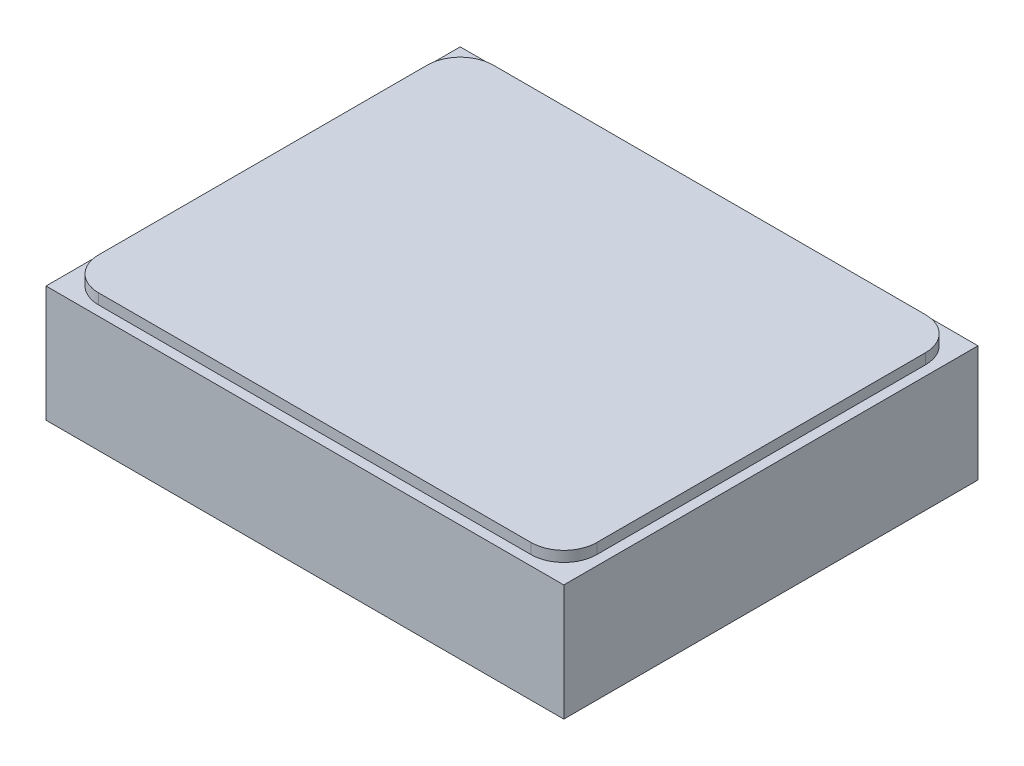
ISO-10303-21;
HEADER;
FILE_DESCRIPTION(('STEP AP214'),'2;1');
FILE_NAME('part.step','',(''),(''),'','','');
FILE_SCHEMA(('AUTOMOTIVE_DESIGN { 1 0 10303 214 1 1 1 1 }'));
ENDSEC;
DATA;
#1=APPLICATION_CONTEXT('core data for automotive mechanical design processes');
#2=APPLICATION_PROTOCOL_DEFINITION('international standard','automotive_design',2000,#1);
#3=PRODUCT_CONTEXT('',#1,'mechanical');
#4=PRODUCT('Part','Part','',(#3));
#5=PRODUCT_RELATED_PRODUCT_CATEGORY('part','',(#4));
#6=PRODUCT_DEFINITION_FORMATION('','',#4);
#7=PRODUCT_DEFINITION_CONTEXT('part definition',#1,'design');
#8=PRODUCT_DEFINITION('design','',#6,#7);
#9=PRODUCT_DEFINITION_SHAPE('','',#8);
#10=(LENGTH_UNIT() NAMED_UNIT(*) SI_UNIT(.MILLI.,.METRE.));
#11=(NAMED_UNIT(*) PLANE_ANGLE_UNIT() SI_UNIT($,.RADIAN.));
#12=(NAMED_UNIT(*) SI_UNIT($,.STERADIAN.) SOLID_ANGLE_UNIT());
#13=UNCERTAINTY_MEASURE_WITH_UNIT(LENGTH_MEASURE(1.E-05),#10,'distance_accuracy_value','');
#14=(GEOMETRIC_REPRESENTATION_CONTEXT(3) GLOBAL_UNCERTAINTY_ASSIGNED_CONTEXT((#13)) GLOBAL_UNIT_ASSIGNED_CONTEXT((#10,
#11,#12)) REPRESENTATION_CONTEXT('',''));
#15=CARTESIAN_POINT('',(0.,0.,0.));
#16=DIRECTION('',(0.,0.,1.));
#17=DIRECTION('',(1.,0.,0.));
#18=AXIS2_PLACEMENT_3D('',#15,#16,#17);
#19=CARTESIAN_POINT('',(-25.,11.9888,-20.));
#20=DIRECTION('',(0.,-1.,0.));
#21=DIRECTION('',(0.,0.,-1.));
#22=AXIS2_PLACEMENT_3D('',#19,#20,#21);
#23=PLANE('',#22);
#24=DIRECTION('',(0.,0.,1.));
#25=VECTOR('',#24,1.);
#26=CARTESIAN_POINT('',(-25.,11.9888,20.));
#27=LINE('',#26,#25);
#28=CARTESIAN_POINT('',(-25.,11.9888,-20.));
#29=VERTEX_POINT('',#28);
#30=CARTESIAN_POINT('',(-25.,11.9888,20.));
#31=VERTEX_POINT('',#30);
#32=EDGE_CURVE('E225',#29,#31,#27,.T.);
#33=ORIENTED_EDGE('',*,*,#32,.T.);
#34=DIRECTION('',(1.,0.,0.));
#35=VECTOR('',#34,1.);
#36=CARTESIAN_POINT('',(-25.,11.9888,20.));
#37=LINE('',#36,#35);
#38=CARTESIAN_POINT('',(25.,11.9888,20.));
#39=VERTEX_POINT('',#38);
#40=EDGE_CURVE('E228',#31,#39,#37,.T.);
#41=ORIENTED_EDGE('',*,*,#40,.T.);
#42=DIRECTION('',(0.,0.,-1.));
#43=VECTOR('',#42,1.);
#44=CARTESIAN_POINT('',(25.,11.9888,20.));
#45=LINE('',#44,#43);
#46=CARTESIAN_POINT('',(25.,11.9888,-20.));
#47=VERTEX_POINT('',#46);
#48=EDGE_CURVE('E230',#39,#47,#45,.T.);
#49=ORIENTED_EDGE('',*,*,#48,.T.);
#50=DIRECTION('',(-1.,0.,0.));
#51=VECTOR('',#50,1.);
#52=CARTESIAN_POINT('',(-25.,11.9888,-20.));
#53=LINE('',#52,#51);
#54=EDGE_CURVE('E232',#47,#29,#53,.T.);
#55=ORIENTED_EDGE('',*,*,#54,.T.);
#56=EDGE_LOOP('',(#33,#41,#49,#55));
#57=FACE_BOUND('',#56,.T.);
#58=CARTESIAN_POINT('',(-20.8725,11.9888,15.8725));
#59=DIRECTION('',(0.,1.,0.));
#60=DIRECTION('',(0.,0.,-1.));
#61=AXIS2_PLACEMENT_3D('',#58,#59,#60);
#62=CIRCLE('',#61,3.175);
#63=CARTESIAN_POINT('',(-24.0475,11.9888,15.8725));
#64=VERTEX_POINT('',#63);
#65=CARTESIAN_POINT('',(-20.8725,11.9888,19.0475));
#66=VERTEX_POINT('',#65);
#67=EDGE_CURVE('E173',#64,#66,#62,.T.);
#68=ORIENTED_EDGE('',*,*,#67,.F.);
#69=DIRECTION('',(0.,0.,1.));
#70=VECTOR('',#69,1.);
#71=CARTESIAN_POINT('',(-24.0475,11.9888,15.8725));
#72=LINE('',#71,#70);
#73=CARTESIAN_POINT('',(-24.0475,11.9888,-15.8775));
#74=VERTEX_POINT('',#73);
#75=EDGE_CURVE('E170',#74,#64,#72,.T.);
#76=ORIENTED_EDGE('',*,*,#75,.F.);
#77=CARTESIAN_POINT('',(-20.8725,11.9888,-15.8775));
#78=DIRECTION('',(0.,1.,0.));
#79=DIRECTION('',(0.,0.,-1.));
#80=AXIS2_PLACEMENT_3D('',#77,#78,#79);
#81=CIRCLE('',#80,3.175);
#82=CARTESIAN_POINT('',(-20.8725,11.9888,-19.0525));
#83=VERTEX_POINT('',#82);
#84=EDGE_CURVE('E646',#83,#74,#81,.T.);
#85=ORIENTED_EDGE('',*,*,#84,.F.);
#86=DIRECTION('',(-1.,0.,0.));
#87=VECTOR('',#86,1.);
#88=CARTESIAN_POINT('',(-20.8725,11.9888,-19.0525));
#89=LINE('',#88,#87);
#90=CARTESIAN_POINT('',(20.8851,11.9888,-19.0525));
#91=VERTEX_POINT('',#90);
#92=EDGE_CURVE('E677',#91,#83,#89,.T.);
#93=ORIENTED_EDGE('',*,*,#92,.F.);
#94=CARTESIAN_POINT('',(20.8851,11.9888,-15.8775));
#95=DIRECTION('',(0.,1.,0.));
#96=DIRECTION('',(0.,0.,-1.));
#97=AXIS2_PLACEMENT_3D('',#94,#95,#96);
#98=CIRCLE('',#97,3.175);
#99=CARTESIAN_POINT('',(24.0601,11.9888,-15.8775));
#100=VERTEX_POINT('',#99);
#101=EDGE_CURVE('E670',#100,#91,#98,.T.);
#102=ORIENTED_EDGE('',*,*,#101,.F.);
#103=DIRECTION('',(0.,0.,-1.));
#104=VECTOR('',#103,1.);
#105=CARTESIAN_POINT('',(24.0601,11.9888,15.8725));
#106=LINE('',#105,#104);
#107=CARTESIAN_POINT('',(24.0601,11.9888,15.8725));
#108=VERTEX_POINT('',#107);
#109=EDGE_CURVE('E667',#108,#100,#106,.T.);
#110=ORIENTED_EDGE('',*,*,#109,.F.);
#111=CARTESIAN_POINT('',(20.8851,11.9888,15.8725));
#112=DIRECTION('',(0.,1.,0.));
#113=DIRECTION('',(0.,0.,1.));
#114=AXIS2_PLACEMENT_3D('',#111,#112,#113);
#115=CIRCLE('',#114,3.175);
#116=CARTESIAN_POINT('',(20.8851,11.9888,19.0475));
#117=VERTEX_POINT('',#116);
#118=EDGE_CURVE('E58',#117,#108,#115,.T.);
#119=ORIENTED_EDGE('',*,*,#118,.F.);
#120=DIRECTION('',(1.,0.,0.));
#121=VECTOR('',#120,1.);
#122=CARTESIAN_POINT('',(-20.8725,11.9888,19.0475));
#123=LINE('',#122,#121);
#124=EDGE_CURVE('E53',#66,#117,#123,.T.);
#125=ORIENTED_EDGE('',*,*,#124,.F.);
#126=EDGE_LOOP('',(#68,#76,#85,#93,#102,#110,#119,#125));
#127=FACE_BOUND('',#126,.T.);
#128=ADVANCED_FACE('F36',(#57,#127),#23,.F.);
#129=CARTESIAN_POINT('',(-25.,11.9888,20.));
#130=DIRECTION('',(1.,0.,0.));
#131=DIRECTION('',(0.,0.,-1.));
#132=AXIS2_PLACEMENT_3D('',#129,#130,#131);
#133=PLANE('',#132);
#134=DIRECTION('',(0.,-1.,0.));
#135=VECTOR('',#134,1.);
#136=CARTESIAN_POINT('',(-25.,11.9888,-20.));
#137=LINE('',#136,#135);
#138=CARTESIAN_POINT('',(-25.,0.762000000000002,-20.));
#139=VERTEX_POINT('',#138);
#140=EDGE_CURVE('E234',#29,#139,#137,.T.);
#141=ORIENTED_EDGE('',*,*,#140,.T.);
#142=DIRECTION('',(0.,0.,1.));
#143=VECTOR('',#142,1.);
#144=CARTESIAN_POINT('',(-25.,0.761999999999999,20.));
#145=LINE('',#144,#143);
#146=CARTESIAN_POINT('',(-25.,0.762000000000002,20.));
#147=VERTEX_POINT('',#146);
#148=EDGE_CURVE('E11',#139,#147,#145,.T.);
#149=ORIENTED_EDGE('',*,*,#148,.T.);
#150=DIRECTION('',(0.,-1.,0.));
#151=VECTOR('',#150,1.);
#152=CARTESIAN_POINT('',(-25.,11.9888,20.));
#153=LINE('',#152,#151);
#154=EDGE_CURVE('E243',#31,#147,#153,.T.);
#155=ORIENTED_EDGE('',*,*,#154,.F.);
#156=ORIENTED_EDGE('',*,*,#32,.F.);
#157=EDGE_LOOP('',(#141,#149,#155,#156));
#158=FACE_BOUND('',#157,.T.);
#159=ADVANCED_FACE('F296',(#158),#133,.F.);
#160=CARTESIAN_POINT('',(-25.,11.9888,20.));
#161=DIRECTION('',(0.,0.,-1.));
#162=DIRECTION('',(-1.,0.,0.));
#163=AXIS2_PLACEMENT_3D('',#160,#161,#162);
#164=PLANE('',#163);
#165=ORIENTED_EDGE('',*,*,#154,.T.);
#166=DIRECTION('',(1.,0.,0.));
#167=VECTOR('',#166,1.);
#168=CARTESIAN_POINT('',(25.,0.761999999999999,20.));
#169=LINE('',#168,#167);
#170=CARTESIAN_POINT('',(25.,0.762000000000002,20.));
#171=VERTEX_POINT('',#170);
#172=EDGE_CURVE('E45',#147,#171,#169,.T.);
#173=ORIENTED_EDGE('',*,*,#172,.T.);
#174=DIRECTION('',(0.,-1.,0.));
#175=VECTOR('',#174,1.);
#176=CARTESIAN_POINT('',(25.,11.9888,20.));
#177=LINE('',#176,#175);
#178=EDGE_CURVE('E240',#39,#171,#177,.T.);
#179=ORIENTED_EDGE('',*,*,#178,.F.);
#180=ORIENTED_EDGE('',*,*,#40,.F.);
#181=EDGE_LOOP('',(#165,#173,#179,#180));
#182=FACE_BOUND('',#181,.T.);
#183=ADVANCED_FACE('F303',(#182),#164,.F.);
#184=CARTESIAN_POINT('',(25.,11.9888,20.));
#185=DIRECTION('',(-1.,0.,0.));
#186=DIRECTION('',(0.,0.,1.));
#187=AXIS2_PLACEMENT_3D('',#184,#185,#186);
#188=PLANE('',#187);
#189=ORIENTED_EDGE('',*,*,#178,.T.);
#190=DIRECTION('',(0.,0.,-1.));
#191=VECTOR('',#190,1.);
#192=CARTESIAN_POINT('',(25.,0.761999999999999,-20.));
#193=LINE('',#192,#191);
#194=CARTESIAN_POINT('',(25.,0.762000000000002,-20.));
#195=VERTEX_POINT('',#194);
#196=EDGE_CURVE('E260',#171,#195,#193,.T.);
#197=ORIENTED_EDGE('',*,*,#196,.T.);
#198=DIRECTION('',(0.,-1.,0.));
#199=VECTOR('',#198,1.);
#200=CARTESIAN_POINT('',(25.,11.9888,-20.));
#201=LINE('',#200,#199);
#202=EDGE_CURVE('E237',#47,#195,#201,.T.);
#203=ORIENTED_EDGE('',*,*,#202,.F.);
#204=ORIENTED_EDGE('',*,*,#48,.F.);
#205=EDGE_LOOP('',(#189,#197,#203,#204));
#206=FACE_BOUND('',#205,.T.);
#207=ADVANCED_FACE('F301',(#206),#188,.F.);
#208=CARTESIAN_POINT('',(-25.,11.9888,-20.));
#209=DIRECTION('',(0.,0.,1.));
#210=DIRECTION('',(1.,0.,0.));
#211=AXIS2_PLACEMENT_3D('',#208,#209,#210);
#212=PLANE('',#211);
#213=CARTESIAN_POINT('',(0.,5.334,-20.));
#214=DIRECTION('',(0.,0.,-1.));
#215=DIRECTION('',(-1.,0.,0.));
#216=AXIS2_PLACEMENT_3D('',#213,#214,#215);
#217=CIRCLE('',#216,2.09999999999999);
#218=CARTESIAN_POINT('',(-2.09999999999999,5.334,-20.));
#219=VERTEX_POINT('',#218);
#220=EDGE_CURVE('E222',#219,#219,#217,.T.);
#221=ORIENTED_EDGE('',*,*,#220,.F.);
#222=EDGE_LOOP('',(#221));
#223=FACE_BOUND('',#222,.T.);
#224=ORIENTED_EDGE('',*,*,#202,.T.);
#225=DIRECTION('',(-1.,0.,0.));
#226=VECTOR('',#225,1.);
#227=CARTESIAN_POINT('',(-25.,0.761999999999999,-20.));
#228=LINE('',#227,#226);
#229=EDGE_CURVE('E246',#195,#139,#228,.T.);
#230=ORIENTED_EDGE('',*,*,#229,.T.);
#231=ORIENTED_EDGE('',*,*,#140,.F.);
#232=ORIENTED_EDGE('',*,*,#54,.F.);
#233=EDGE_LOOP('',(#224,#230,#231,#232));
#234=FACE_BOUND('',#233,.T.);
#235=ADVANCED_FACE('F292',(#223,#234),#212,.F.);
#236=CARTESIAN_POINT('',(-25.,0.,-20.));
#237=DIRECTION('',(0.,-1.,0.));
#238=DIRECTION('',(0.,0.,-1.));
#239=AXIS2_PLACEMENT_3D('',#236,#237,#238);
#240=PLANE('',#239);
#241=DIRECTION('',(0.,0.,-1.));
#242=VECTOR('',#241,1.);
#243=CARTESIAN_POINT('',(-24.238,0.,-20.));
#244=LINE('',#243,#242);
#245=CARTESIAN_POINT('',(-24.238,0.,19.238));
#246=VERTEX_POINT('',#245);
#247=CARTESIAN_POINT('',(-24.238,0.,-19.238));
#248=VERTEX_POINT('',#247);
#249=EDGE_CURVE('E251',#246,#248,#244,.T.);
#250=ORIENTED_EDGE('',*,*,#249,.T.);
#251=DIRECTION('',(1.,0.,0.));
#252=VECTOR('',#251,1.);
#253=CARTESIAN_POINT('',(25.,0.,-19.238));
#254=LINE('',#253,#252);
#255=CARTESIAN_POINT('',(24.238,0.,-19.238));
#256=VERTEX_POINT('',#255);
#257=EDGE_CURVE('E257',#248,#256,#254,.T.);
#258=ORIENTED_EDGE('',*,*,#257,.T.);
#259=DIRECTION('',(0.,0.,1.));
#260=VECTOR('',#259,1.);
#261=CARTESIAN_POINT('',(24.238,0.,20.));
#262=LINE('',#261,#260);
#263=CARTESIAN_POINT('',(24.238,0.,19.238));
#264=VERTEX_POINT('',#263);
#265=EDGE_CURVE('E255',#256,#264,#262,.T.);
#266=ORIENTED_EDGE('',*,*,#265,.T.);
#267=DIRECTION('',(-1.,0.,0.));
#268=VECTOR('',#267,1.);
#269=CARTESIAN_POINT('',(-25.,0.,19.238));
#270=LINE('',#269,#268);
#271=EDGE_CURVE('E253',#264,#246,#270,.T.);
#272=ORIENTED_EDGE('',*,*,#271,.T.);
#273=EDGE_LOOP('',(#250,#258,#266,#272));
#274=FACE_BOUND('',#273,.T.);
#275=CARTESIAN_POINT('',(-17.,0.,0.));
#276=DIRECTION('',(0.,-1.,0.));
#277=DIRECTION('',(0.,0.,-1.));
#278=AXIS2_PLACEMENT_3D('',#275,#276,#277);
#279=CIRCLE('',#278,1.25);
#280=CARTESIAN_POINT('',(-17.,0.,-1.25));
#281=VERTEX_POINT('',#280);
#282=EDGE_CURVE('E185',#281,#281,#279,.T.);
#283=ORIENTED_EDGE('',*,*,#282,.F.);
#284=EDGE_LOOP('',(#283));
#285=FACE_BOUND('',#284,.T.);
#286=CARTESIAN_POINT('',(0.,0.,0.));
#287=DIRECTION('',(0.,-1.,0.));
#288=DIRECTION('',(0.,0.,-1.));
#289=AXIS2_PLACEMENT_3D('',#286,#287,#288);
#290=CIRCLE('',#289,6.48252587808178);
#291=CARTESIAN_POINT('',(0.,0.,-6.48252587808178));
#292=VERTEX_POINT('',#291);
#293=EDGE_CURVE('E189',#292,#292,#290,.T.);
#294=ORIENTED_EDGE('',*,*,#293,.F.);
#295=EDGE_LOOP('',(#294));
#296=FACE_BOUND('',#295,.T.);
#297=CARTESIAN_POINT('',(5.39749999999991,0.,-9.34874423385306));
#298=DIRECTION('',(0.,-1.,0.));
#299=DIRECTION('',(0.,0.,-1.));
#300=AXIS2_PLACEMENT_3D('',#297,#298,#299);
#301=CIRCLE('',#300,1.25);
#302=CARTESIAN_POINT('',(5.39749999999991,0.,-10.5987442338531));
#303=VERTEX_POINT('',#302);
#304=EDGE_CURVE('E198',#303,#303,#301,.T.);
#305=ORIENTED_EDGE('',*,*,#304,.F.);
#306=EDGE_LOOP('',(#305));
#307=FACE_BOUND('',#306,.T.);
#308=CARTESIAN_POINT('',(5.39750000000004,0.,9.34874423385299));
#309=DIRECTION('',(0.,-1.,0.));
#310=DIRECTION('',(0.,0.,-1.));
#311=AXIS2_PLACEMENT_3D('',#308,#309,#310);
#312=CIRCLE('',#311,1.25);
#313=CARTESIAN_POINT('',(5.39750000000004,0.,8.09874423385299));
#314=VERTEX_POINT('',#313);
#315=EDGE_CURVE('E204',#314,#314,#312,.T.);
#316=ORIENTED_EDGE('',*,*,#315,.F.);
#317=EDGE_LOOP('',(#316));
#318=FACE_BOUND('',#317,.T.);
#319=CARTESIAN_POINT('',(-10.795,0.,0.));
#320=DIRECTION('',(0.,-1.,0.));
#321=DIRECTION('',(0.,0.,-1.));
#322=AXIS2_PLACEMENT_3D('',#319,#320,#321);
#323=CIRCLE('',#322,1.25);
#324=CARTESIAN_POINT('',(-10.795,0.,-1.25));
#325=VERTEX_POINT('',#324);
#326=EDGE_CURVE('E210',#325,#325,#323,.T.);
#327=ORIENTED_EDGE('',*,*,#326,.F.);
#328=EDGE_LOOP('',(#327));
#329=FACE_BOUND('',#328,.T.);
#330=CARTESIAN_POINT('',(17.,0.,0.));
#331=DIRECTION('',(0.,-1.,0.));
#332=DIRECTION('',(0.,0.,-1.));
#333=AXIS2_PLACEMENT_3D('',#330,#331,#332);
#334=CIRCLE('',#333,1.58749999999996);
#335=CARTESIAN_POINT('',(17.,0.,-1.58749999999996));
#336=VERTEX_POINT('',#335);
#337=EDGE_CURVE('E216',#336,#336,#334,.T.);
#338=ORIENTED_EDGE('',*,*,#337,.F.);
#339=EDGE_LOOP('',(#338));
#340=FACE_BOUND('',#339,.T.);
#341=ADVANCED_FACE('F280',(#274,#285,#296,#307,#318,#329,#340),#240,.T.);
#342=CARTESIAN_POINT('',(0.,5.334,-20.));
#343=DIRECTION('',(0.,0.,-1.));
#344=DIRECTION('',(-1.,0.,0.));
#345=AXIS2_PLACEMENT_3D('',#342,#343,#344);
#346=CYLINDRICAL_SURFACE('',#345,2.09999999999999);
#347=CARTESIAN_POINT('',(0.,5.334,-10.4242));
#348=DIRECTION('',(0.,0.,-1.));
#349=DIRECTION('',(-1.,0.,0.));
#350=AXIS2_PLACEMENT_3D('',#347,#348,#349);
#351=CIRCLE('',#350,2.1);
#352=CARTESIAN_POINT('',(-2.1,5.334,-10.4242));
#353=VERTEX_POINT('',#352);
#354=EDGE_CURVE('E219',#353,#353,#351,.T.);
#355=ORIENTED_EDGE('',*,*,#354,.F.);
#356=EDGE_LOOP('',(#355));
#357=FACE_BOUND('',#356,.T.);
#358=ORIENTED_EDGE('',*,*,#220,.T.);
#359=EDGE_LOOP('',(#358));
#360=FACE_BOUND('',#359,.T.);
#361=ADVANCED_FACE('F318',(#357,#360),#346,.F.);
#362=CARTESIAN_POINT('',(0.,5.334,-10.4242));
#363=DIRECTION('',(0.,0.,-1.));
#364=DIRECTION('',(-1.,0.,0.));
#365=AXIS2_PLACEMENT_3D('',#362,#363,#364);
#366=CONICAL_SURFACE('',#365,2.1,1.02974425867665);
#367=CARTESIAN_POINT('',(0.,5.334,-9.16239270004212));
#368=VERTEX_POINT('',#367);
#369=VERTEX_LOOP('',#368);
#370=FACE_BOUND('',#369,.T.);
#371=ORIENTED_EDGE('',*,*,#354,.T.);
#372=EDGE_LOOP('',(#371));
#373=FACE_BOUND('',#372,.T.);
#374=ADVANCED_FACE('F329',(#370,#373),#366,.F.);
#375=CARTESIAN_POINT('',(17.,0.,0.));
#376=DIRECTION('',(0.,-1.,0.));
#377=DIRECTION('',(0.,0.,-1.));
#378=AXIS2_PLACEMENT_3D('',#375,#376,#377);
#379=CYLINDRICAL_SURFACE('',#378,1.58749999999996);
#380=CARTESIAN_POINT('',(17.,6.35000000000002,0.));
#381=DIRECTION('',(0.,-1.,0.));
#382=DIRECTION('',(0.,0.,-1.));
#383=AXIS2_PLACEMENT_3D('',#380,#381,#382);
#384=CIRCLE('',#383,1.58749999999996);
#385=CARTESIAN_POINT('',(17.,6.35000000000002,-1.58749999999996));
#386=VERTEX_POINT('',#385);
#387=EDGE_CURVE('E213',#386,#386,#384,.T.);
#388=ORIENTED_EDGE('',*,*,#387,.F.);
#389=EDGE_LOOP('',(#388));
#390=FACE_BOUND('',#389,.T.);
#391=ORIENTED_EDGE('',*,*,#337,.T.);
#392=EDGE_LOOP('',(#391));
#393=FACE_BOUND('',#392,.T.);
#394=ADVANCED_FACE('F334',(#390,#393),#379,.F.);
#395=CARTESIAN_POINT('',(17.,6.35000000000001,0.));
#396=DIRECTION('',(0.,1.,0.));
#397=DIRECTION('',(0.,0.,1.));
#398=AXIS2_PLACEMENT_3D('',#395,#396,#397);
#399=PLANE('',#398);
#400=ORIENTED_EDGE('',*,*,#387,.T.);
#401=EDGE_LOOP('',(#400));
#402=FACE_BOUND('',#401,.T.);
#403=ADVANCED_FACE('F341',(#402),#399,.F.);
#404=CARTESIAN_POINT('',(-10.795,0.,0.));
#405=DIRECTION('',(0.,-1.,0.));
#406=DIRECTION('',(0.,0.,-1.));
#407=AXIS2_PLACEMENT_3D('',#404,#405,#406);
#408=CYLINDRICAL_SURFACE('',#407,1.25);
#409=CARTESIAN_POINT('',(-10.795,6.5532,0.));
#410=DIRECTION('',(0.,-1.,0.));
#411=DIRECTION('',(0.,0.,-1.));
#412=AXIS2_PLACEMENT_3D('',#409,#410,#411);
#413=CIRCLE('',#412,1.25);
#414=CARTESIAN_POINT('',(-10.795,6.5532,-1.25));
#415=VERTEX_POINT('',#414);
#416=EDGE_CURVE('E207',#415,#415,#413,.T.);
#417=ORIENTED_EDGE('',*,*,#416,.F.);
#418=EDGE_LOOP('',(#417));
#419=FACE_BOUND('',#418,.T.);
#420=ORIENTED_EDGE('',*,*,#326,.T.);
#421=EDGE_LOOP('',(#420));
#422=FACE_BOUND('',#421,.T.);
#423=ADVANCED_FACE('F347',(#419,#422),#408,.F.);
#424=CARTESIAN_POINT('',(-10.795,6.5532,0.));
#425=DIRECTION('',(0.,-1.,0.));
#426=DIRECTION('',(0.,0.,-1.));
#427=AXIS2_PLACEMENT_3D('',#424,#425,#426);
#428=CONICAL_SURFACE('',#427,1.25,1.02974425867665);
#429=CARTESIAN_POINT('',(-10.795,7.30427577378445,0.));
#430=VERTEX_POINT('',#429);
#431=VERTEX_LOOP('',#430);
#432=FACE_BOUND('',#431,.T.);
#433=ORIENTED_EDGE('',*,*,#416,.T.);
#434=EDGE_LOOP('',(#433));
#435=FACE_BOUND('',#434,.T.);
#436=ADVANCED_FACE('F351',(#432,#435),#428,.F.);
#437=CARTESIAN_POINT('',(5.39750000000004,0.,9.34874423385299));
#438=DIRECTION('',(0.,-1.,0.));
#439=DIRECTION('',(0.,0.,-1.));
#440=AXIS2_PLACEMENT_3D('',#437,#438,#439);
#441=CYLINDRICAL_SURFACE('',#440,1.25);
#442=CARTESIAN_POINT('',(5.39750000000004,6.5532,9.34874423385299));
#443=DIRECTION('',(0.,-1.,0.));
#444=DIRECTION('',(0.,0.,-1.));
#445=AXIS2_PLACEMENT_3D('',#442,#443,#444);
#446=CIRCLE('',#445,1.25);
#447=CARTESIAN_POINT('',(5.39750000000004,6.5532,8.09874423385299));
#448=VERTEX_POINT('',#447);
#449=EDGE_CURVE('E201',#448,#448,#446,.T.);
#450=ORIENTED_EDGE('',*,*,#449,.F.);
#451=EDGE_LOOP('',(#450));
#452=FACE_BOUND('',#451,.T.);
#453=ORIENTED_EDGE('',*,*,#315,.T.);
#454=EDGE_LOOP('',(#453));
#455=FACE_BOUND('',#454,.T.);
#456=ADVANCED_FACE('F355',(#452,#455),#441,.F.);
#457=CARTESIAN_POINT('',(5.39750000000004,6.5532,9.34874423385299));
#458=DIRECTION('',(0.,-1.,0.));
#459=DIRECTION('',(0.,0.,-1.));
#460=AXIS2_PLACEMENT_3D('',#457,#458,#459);
#461=CONICAL_SURFACE('',#460,1.25,1.02974425867665);
#462=CARTESIAN_POINT('',(5.39750000000004,7.30427577378445,9.34874423385299));
#463=VERTEX_POINT('',#462);
#464=VERTEX_LOOP('',#463);
#465=FACE_BOUND('',#464,.T.);
#466=ORIENTED_EDGE('',*,*,#449,.T.);
#467=EDGE_LOOP('',(#466));
#468=FACE_BOUND('',#467,.T.);
#469=ADVANCED_FACE('F359',(#465,#468),#461,.F.);
#470=CARTESIAN_POINT('',(5.39749999999991,0.,-9.34874423385306));
#471=DIRECTION('',(0.,-1.,0.));
#472=DIRECTION('',(0.,0.,-1.));
#473=AXIS2_PLACEMENT_3D('',#470,#471,#472);
#474=CYLINDRICAL_SURFACE('',#473,1.25);
#475=CARTESIAN_POINT('',(5.39749999999991,6.5532,-9.34874423385306));
#476=DIRECTION('',(0.,-1.,0.));
#477=DIRECTION('',(0.,0.,-1.));
#478=AXIS2_PLACEMENT_3D('',#475,#476,#477);
#479=CIRCLE('',#478,1.25);
#480=CARTESIAN_POINT('',(5.39749999999991,6.5532,-10.5987442338531));
#481=VERTEX_POINT('',#480);
#482=EDGE_CURVE('E195',#481,#481,#479,.T.);
#483=ORIENTED_EDGE('',*,*,#482,.F.);
#484=EDGE_LOOP('',(#483));
#485=FACE_BOUND('',#484,.T.);
#486=ORIENTED_EDGE('',*,*,#304,.T.);
#487=EDGE_LOOP('',(#486));
#488=FACE_BOUND('',#487,.T.);
#489=ADVANCED_FACE('F363',(#485,#488),#474,.F.);
#490=CARTESIAN_POINT('',(5.39749999999991,6.5532,-9.34874423385306));
#491=DIRECTION('',(0.,-1.,0.));
#492=DIRECTION('',(0.,0.,-1.));
#493=AXIS2_PLACEMENT_3D('',#490,#491,#492);
#494=CONICAL_SURFACE('',#493,1.25,1.02974425867665);
#495=CARTESIAN_POINT('',(5.39749999999991,7.30427577378445,-9.34874423385306));
#496=VERTEX_POINT('',#495);
#497=VERTEX_LOOP('',#496);
#498=FACE_BOUND('',#497,.T.);
#499=ORIENTED_EDGE('',*,*,#482,.T.);
#500=EDGE_LOOP('',(#499));
#501=FACE_BOUND('',#500,.T.);
#502=ADVANCED_FACE('F367',(#498,#501),#494,.F.);
#503=CARTESIAN_POINT('',(0.,-0.508,0.));
#504=DIRECTION('',(0.,0.,-1.));
#505=DIRECTION('',(1.,0.,0.));
#506=AXIS2_PLACEMENT_3D('',#503,#504,#505);
#507=SPHERICAL_SURFACE('',#506,6.5024);
#508=CARTESIAN_POINT('',(0.,-0.508,0.));
#509=DIRECTION('',(0.,-1.,0.));
#510=DIRECTION('',(0.,0.,-1.));
#511=AXIS2_PLACEMENT_3D('',#508,#509,#510);
#512=SPHERICAL_SURFACE('',#511,6.5024);
#513=ORIENTED_EDGE('',*,*,#293,.T.);
#514=EDGE_LOOP('',(#513));
#515=FACE_BOUND('',#514,.T.);
#516=CARTESIAN_POINT('',(0.,5.68420975253383,0.));
#517=DIRECTION('',(0.,-1.,0.));
#518=DIRECTION('',(0.,0.,-1.));
#519=AXIS2_PLACEMENT_3D('',#516,#517,#518);
#520=CIRCLE('',#519,1.984375);
#521=CARTESIAN_POINT('',(0.,5.68420975253383,-1.984375));
#522=VERTEX_POINT('',#521);
#523=EDGE_CURVE('E188',#522,#522,#520,.T.);
#524=ORIENTED_EDGE('',*,*,#523,.F.);
#525=EDGE_LOOP('',(#524));
#526=FACE_BOUND('',#525,.T.);
#527=ADVANCED_FACE('F371',(#515,#526),#512,.F.);
#528=CARTESIAN_POINT('',(0.,6.2484,0.));
#529=DIRECTION('',(0.,1.,0.));
#530=DIRECTION('',(0.,0.,1.));
#531=AXIS2_PLACEMENT_3D('',#528,#529,#530);
#532=PLANE('',#531);
#533=CARTESIAN_POINT('',(0.,6.2484,0.));
#534=DIRECTION('',(0.,-1.,0.));
#535=DIRECTION('',(0.,0.,-1.));
#536=AXIS2_PLACEMENT_3D('',#533,#534,#535);
#537=CIRCLE('',#536,1.984375);
#538=CARTESIAN_POINT('',(0.,6.2484,-1.984375));
#539=VERTEX_POINT('',#538);
#540=EDGE_CURVE('E192',#539,#539,#537,.T.);
#541=ORIENTED_EDGE('',*,*,#540,.T.);
#542=EDGE_LOOP('',(#541));
#543=FACE_BOUND('',#542,.T.);
#544=ADVANCED_FACE('F377',(#543),#532,.F.);
#545=CARTESIAN_POINT('',(0.,0.,0.));
#546=DIRECTION('',(0.,-1.,0.));
#547=DIRECTION('',(0.,0.,-1.));
#548=AXIS2_PLACEMENT_3D('',#545,#546,#547);
#549=CYLINDRICAL_SURFACE('',#548,1.984375);
#550=ORIENTED_EDGE('',*,*,#523,.T.);
#551=EDGE_LOOP('',(#550));
#552=FACE_BOUND('',#551,.T.);
#553=ORIENTED_EDGE('',*,*,#540,.F.);
#554=EDGE_LOOP('',(#553));
#555=FACE_BOUND('',#554,.T.);
#556=ADVANCED_FACE('F373',(#552,#555),#549,.F.);
#557=CARTESIAN_POINT('',(-17.,0.,0.));
#558=DIRECTION('',(0.,-1.,0.));
#559=DIRECTION('',(0.,0.,-1.));
#560=AXIS2_PLACEMENT_3D('',#557,#558,#559);
#561=CYLINDRICAL_SURFACE('',#560,1.25);
#562=CARTESIAN_POINT('',(-17.,5.7912,0.));
#563=DIRECTION('',(0.,-1.,0.));
#564=DIRECTION('',(0.,0.,-1.));
#565=AXIS2_PLACEMENT_3D('',#562,#563,#564);
#566=CIRCLE('',#565,1.25);
#567=CARTESIAN_POINT('',(-17.,5.7912,-1.25));
#568=VERTEX_POINT('',#567);
#569=EDGE_CURVE('E182',#568,#568,#566,.T.);
#570=ORIENTED_EDGE('',*,*,#569,.F.);
#571=EDGE_LOOP('',(#570));
#572=FACE_BOUND('',#571,.T.);
#573=ORIENTED_EDGE('',*,*,#282,.T.);
#574=EDGE_LOOP('',(#573));
#575=FACE_BOUND('',#574,.T.);
#576=ADVANCED_FACE('F376',(#572,#575),#561,.F.);
#577=CARTESIAN_POINT('',(-17.,5.7912,0.));
#578=DIRECTION('',(0.,-1.,0.));
#579=DIRECTION('',(0.,0.,-1.));
#580=AXIS2_PLACEMENT_3D('',#577,#578,#579);
#581=CONICAL_SURFACE('',#580,1.25,1.02974425867665);
#582=CARTESIAN_POINT('',(-17.,6.54227577378445,0.));
#583=VERTEX_POINT('',#582);
#584=VERTEX_LOOP('',#583);
#585=FACE_BOUND('',#584,.T.);
#586=ORIENTED_EDGE('',*,*,#569,.T.);
#587=EDGE_LOOP('',(#586));
#588=FACE_BOUND('',#587,.T.);
#589=ADVANCED_FACE('F387',(#585,#588),#581,.F.);
#590=CARTESIAN_POINT('',(-25.,0.761999999999999,20.));
#591=DIRECTION('',(0.,-0.707106781186548,0.707106781186548));
#592=DIRECTION('',(0.,-0.707106781186548,-0.707106781186548));
#593=AXIS2_PLACEMENT_3D('',#590,#591,#592);
#594=PLANE('',#593);
#595=DIRECTION('',(-0.577350269189626,0.577350269189626,0.577350269189626));
#596=VECTOR('',#595,1.);
#597=CARTESIAN_POINT('',(-25.,0.761999999999999,20.));
#598=LINE('',#597,#596);
#599=EDGE_CURVE('E263',#246,#147,#598,.T.);
#600=ORIENTED_EDGE('',*,*,#599,.F.);
#601=ORIENTED_EDGE('',*,*,#271,.F.);
#602=DIRECTION('',(0.577350269189626,0.577350269189626,0.577350269189626));
#603=VECTOR('',#602,1.);
#604=CARTESIAN_POINT('',(8.33333333333334,-15.9046666666667,3.33333333333334));
#605=LINE('',#604,#603);
#606=EDGE_CURVE('E40',#171,#264,#605,.F.);
#607=ORIENTED_EDGE('',*,*,#606,.F.);
#608=ORIENTED_EDGE('',*,*,#172,.F.);
#609=EDGE_LOOP('',(#600,#601,#607,#608));
#610=FACE_BOUND('',#609,.T.);
#611=ADVANCED_FACE('F38',(#610),#594,.T.);
#612=CARTESIAN_POINT('',(25.,0.761999999999999,20.));
#613=DIRECTION('',(0.707106781186548,-0.707106781186548,0.));
#614=DIRECTION('',(0.707106781186548,0.707106781186548,0.));
#615=AXIS2_PLACEMENT_3D('',#612,#613,#614);
#616=PLANE('',#615);
#617=ORIENTED_EDGE('',*,*,#606,.T.);
#618=ORIENTED_EDGE('',*,*,#265,.F.);
#619=DIRECTION('',(0.577350269189626,0.577350269189626,-0.577350269189626));
#620=VECTOR('',#619,1.);
#621=CARTESIAN_POINT('',(11.6666666666667,-12.5713333333333,-6.66666666666666));
#622=LINE('',#621,#620);
#623=EDGE_CURVE('E176',#195,#256,#622,.F.);
#624=ORIENTED_EDGE('',*,*,#623,.F.);
#625=ORIENTED_EDGE('',*,*,#196,.F.);
#626=EDGE_LOOP('',(#617,#618,#624,#625));
#627=FACE_BOUND('',#626,.T.);
#628=ADVANCED_FACE('F274',(#627),#616,.T.);
#629=CARTESIAN_POINT('',(-25.,0.761999999999999,20.));
#630=DIRECTION('',(-0.707106781186548,-0.707106781186548,0.));
#631=DIRECTION('',(0.707106781186548,-0.707106781186548,0.));
#632=AXIS2_PLACEMENT_3D('',#629,#630,#631);
#633=PLANE('',#632);
#634=ORIENTED_EDGE('',*,*,#599,.T.);
#635=ORIENTED_EDGE('',*,*,#148,.F.);
#636=DIRECTION('',(0.577350269189626,-0.577350269189626,0.577350269189626));
#637=VECTOR('',#636,1.);
#638=CARTESIAN_POINT('',(-11.6666666666667,-12.5713333333333,-6.66666666666666));
#639=LINE('',#638,#637);
#640=EDGE_CURVE('E174',#248,#139,#639,.F.);
#641=ORIENTED_EDGE('',*,*,#640,.F.);
#642=ORIENTED_EDGE('',*,*,#249,.F.);
#643=EDGE_LOOP('',(#634,#635,#641,#642));
#644=FACE_BOUND('',#643,.T.);
#645=ADVANCED_FACE('F287',(#644),#633,.T.);
#646=CARTESIAN_POINT('',(-25.,0.761999999999999,-20.));
#647=DIRECTION('',(0.,-0.707106781186548,-0.707106781186548));
#648=DIRECTION('',(0.,0.707106781186548,-0.707106781186548));
#649=AXIS2_PLACEMENT_3D('',#646,#647,#648);
#650=PLANE('',#649);
#651=ORIENTED_EDGE('',*,*,#623,.T.);
#652=ORIENTED_EDGE('',*,*,#257,.F.);
#653=ORIENTED_EDGE('',*,*,#640,.T.);
#654=ORIENTED_EDGE('',*,*,#229,.F.);
#655=EDGE_LOOP('',(#651,#652,#653,#654));
#656=FACE_BOUND('',#655,.T.);
#657=ADVANCED_FACE('F285',(#656),#650,.T.);
#658=CARTESIAN_POINT('',(-20.8725,13.0048,15.8725));
#659=DIRECTION('',(0.,-1.,0.));
#660=DIRECTION('',(0.,0.,-1.));
#661=AXIS2_PLACEMENT_3D('',#658,#659,#660);
#662=CYLINDRICAL_SURFACE('',#661,3.175);
#663=ORIENTED_EDGE('',*,*,#67,.T.);
#664=DIRECTION('',(0.,-1.,0.));
#665=VECTOR('',#664,1.);
#666=CARTESIAN_POINT('',(-20.8725,13.0048,19.0475));
#667=LINE('',#666,#665);
#668=CARTESIAN_POINT('',(-20.8725,13.0048,19.0475));
#669=VERTEX_POINT('',#668);
#670=EDGE_CURVE('E154',#669,#66,#667,.T.);
#671=ORIENTED_EDGE('',*,*,#670,.F.);
#672=CARTESIAN_POINT('',(-20.8725,13.0048,15.8725));
#673=DIRECTION('',(0.,1.,0.));
#674=DIRECTION('',(0.,0.,-1.));
#675=AXIS2_PLACEMENT_3D('',#672,#673,#674);
#676=CIRCLE('',#675,3.175);
#677=CARTESIAN_POINT('',(-24.0475,13.0048,15.8725));
#678=VERTEX_POINT('',#677);
#679=EDGE_CURVE('E161',#678,#669,#676,.T.);
#680=ORIENTED_EDGE('',*,*,#679,.F.);
#681=DIRECTION('',(0.,-1.,0.));
#682=VECTOR('',#681,1.);
#683=CARTESIAN_POINT('',(-24.0475,13.0048,15.8725));
#684=LINE('',#683,#682);
#685=EDGE_CURVE('E642',#678,#64,#684,.T.);
#686=ORIENTED_EDGE('',*,*,#685,.T.);
#687=EDGE_LOOP('',(#663,#671,#680,#686));
#688=FACE_BOUND('',#687,.T.);
#689=ADVANCED_FACE('F172',(#688),#662,.T.);
#690=CARTESIAN_POINT('',(-20.8725,13.0048,19.0475));
#691=DIRECTION('',(0.,0.,-1.));
#692=DIRECTION('',(-1.,0.,0.));
#693=AXIS2_PLACEMENT_3D('',#690,#691,#692);
#694=PLANE('',#693);
#695=ORIENTED_EDGE('',*,*,#124,.T.);
#696=DIRECTION('',(0.,-1.,0.));
#697=VECTOR('',#696,1.);
#698=CARTESIAN_POINT('',(20.8851,13.0048,19.0475));
#699=LINE('',#698,#697);
#700=CARTESIAN_POINT('',(20.8851,13.0048,19.0475));
#701=VERTEX_POINT('',#700);
#702=EDGE_CURVE('E157',#701,#117,#699,.T.);
#703=ORIENTED_EDGE('',*,*,#702,.F.);
#704=DIRECTION('',(1.,0.,0.));
#705=VECTOR('',#704,1.);
#706=CARTESIAN_POINT('',(-20.8725,13.0048,19.0475));
#707=LINE('',#706,#705);
#708=EDGE_CURVE('E150',#669,#701,#707,.T.);
#709=ORIENTED_EDGE('',*,*,#708,.F.);
#710=ORIENTED_EDGE('',*,*,#670,.T.);
#711=EDGE_LOOP('',(#695,#703,#709,#710));
#712=FACE_BOUND('',#711,.T.);
#713=ADVANCED_FACE('F152',(#712),#694,.F.);
#714=CARTESIAN_POINT('',(20.8851,13.0048,15.8725));
#715=DIRECTION('',(0.,-1.,0.));
#716=DIRECTION('',(0.,0.,-1.));
#717=AXIS2_PLACEMENT_3D('',#714,#715,#716);
#718=CYLINDRICAL_SURFACE('',#717,3.175);
#719=ORIENTED_EDGE('',*,*,#118,.T.);
#720=DIRECTION('',(0.,-1.,0.));
#721=VECTOR('',#720,1.);
#722=CARTESIAN_POINT('',(24.0601,13.0048,15.8725));
#723=LINE('',#722,#721);
#724=CARTESIAN_POINT('',(24.0601,13.0048,15.8725));
#725=VERTEX_POINT('',#724);
#726=EDGE_CURVE('E178',#725,#108,#723,.T.);
#727=ORIENTED_EDGE('',*,*,#726,.F.);
#728=CARTESIAN_POINT('',(20.8851,13.0048,15.8725));
#729=DIRECTION('',(0.,1.,0.));
#730=DIRECTION('',(0.,0.,1.));
#731=AXIS2_PLACEMENT_3D('',#728,#729,#730);
#732=CIRCLE('',#731,3.175);
#733=EDGE_CURVE('E160',#701,#725,#732,.T.);
#734=ORIENTED_EDGE('',*,*,#733,.F.);
#735=ORIENTED_EDGE('',*,*,#702,.T.);
#736=EDGE_LOOP('',(#719,#727,#734,#735));
#737=FACE_BOUND('',#736,.T.);
#738=ADVANCED_FACE('F396',(#737),#718,.T.);
#739=CARTESIAN_POINT('',(24.0601,13.0048,15.8725));
#740=DIRECTION('',(-1.,0.,0.));
#741=DIRECTION('',(0.,0.,1.));
#742=AXIS2_PLACEMENT_3D('',#739,#740,#741);
#743=PLANE('',#742);
#744=ORIENTED_EDGE('',*,*,#109,.T.);
#745=DIRECTION('',(0.,-1.,0.));
#746=VECTOR('',#745,1.);
#747=CARTESIAN_POINT('',(24.0601,13.0048,-15.8775));
#748=LINE('',#747,#746);
#749=CARTESIAN_POINT('',(24.0601,13.0048,-15.8775));
#750=VERTEX_POINT('',#749);
#751=EDGE_CURVE('E660',#750,#100,#748,.T.);
#752=ORIENTED_EDGE('',*,*,#751,.F.);
#753=DIRECTION('',(0.,0.,-1.));
#754=VECTOR('',#753,1.);
#755=CARTESIAN_POINT('',(24.0601,13.0048,15.8725));
#756=LINE('',#755,#754);
#757=EDGE_CURVE('E668',#725,#750,#756,.T.);
#758=ORIENTED_EDGE('',*,*,#757,.F.);
#759=ORIENTED_EDGE('',*,*,#726,.T.);
#760=EDGE_LOOP('',(#744,#752,#758,#759));
#761=FACE_BOUND('',#760,.T.);
#762=ADVANCED_FACE('F399',(#761),#743,.F.);
#763=CARTESIAN_POINT('',(20.8851,13.0048,-15.8775));
#764=DIRECTION('',(0.,-1.,0.));
#765=DIRECTION('',(0.,0.,-1.));
#766=AXIS2_PLACEMENT_3D('',#763,#764,#765);
#767=CYLINDRICAL_SURFACE('',#766,3.175);
#768=ORIENTED_EDGE('',*,*,#101,.T.);
#769=DIRECTION('',(0.,-1.,0.));
#770=VECTOR('',#769,1.);
#771=CARTESIAN_POINT('',(20.8851,13.0048,-19.0525));
#772=LINE('',#771,#770);
#773=CARTESIAN_POINT('',(20.8851,13.0048,-19.0525));
#774=VERTEX_POINT('',#773);
#775=EDGE_CURVE('E657',#774,#91,#772,.T.);
#776=ORIENTED_EDGE('',*,*,#775,.F.);
#777=CARTESIAN_POINT('',(20.8851,13.0048,-15.8775));
#778=DIRECTION('',(0.,1.,0.));
#779=DIRECTION('',(0.,0.,-1.));
#780=AXIS2_PLACEMENT_3D('',#777,#778,#779);
#781=CIRCLE('',#780,3.175);
#782=EDGE_CURVE('E685',#750,#774,#781,.T.);
#783=ORIENTED_EDGE('',*,*,#782,.F.);
#784=ORIENTED_EDGE('',*,*,#751,.T.);
#785=EDGE_LOOP('',(#768,#776,#783,#784));
#786=FACE_BOUND('',#785,.T.);
#787=ADVANCED_FACE('F403',(#786),#767,.T.);
#788=CARTESIAN_POINT('',(-20.8725,13.0048,-19.0525));
#789=DIRECTION('',(0.,0.,1.));
#790=DIRECTION('',(1.,0.,0.));
#791=AXIS2_PLACEMENT_3D('',#788,#789,#790);
#792=PLANE('',#791);
#793=ORIENTED_EDGE('',*,*,#92,.T.);
#794=DIRECTION('',(0.,-1.,0.));
#795=VECTOR('',#794,1.);
#796=CARTESIAN_POINT('',(-20.8725,13.0048,-19.0525));
#797=LINE('',#796,#795);
#798=CARTESIAN_POINT('',(-20.8725,13.0048,-19.0525));
#799=VERTEX_POINT('',#798);
#800=EDGE_CURVE('E649',#799,#83,#797,.T.);
#801=ORIENTED_EDGE('',*,*,#800,.F.);
#802=DIRECTION('',(-1.,0.,0.));
#803=VECTOR('',#802,1.);
#804=CARTESIAN_POINT('',(-20.8725,13.0048,-19.0525));
#805=LINE('',#804,#803);
#806=EDGE_CURVE('E683',#774,#799,#805,.T.);
#807=ORIENTED_EDGE('',*,*,#806,.F.);
#808=ORIENTED_EDGE('',*,*,#775,.T.);
#809=EDGE_LOOP('',(#793,#801,#807,#808));
#810=FACE_BOUND('',#809,.T.);
#811=ADVANCED_FACE('F407',(#810),#792,.F.);
#812=CARTESIAN_POINT('',(-20.8725,13.0048,-15.8775));
#813=DIRECTION('',(0.,-1.,0.));
#814=DIRECTION('',(0.,0.,-1.));
#815=AXIS2_PLACEMENT_3D('',#812,#813,#814);
#816=CYLINDRICAL_SURFACE('',#815,3.175);
#817=ORIENTED_EDGE('',*,*,#84,.T.);
#818=DIRECTION('',(0.,-1.,0.));
#819=VECTOR('',#818,1.);
#820=CARTESIAN_POINT('',(-24.0475,13.0048,-15.8775));
#821=LINE('',#820,#819);
#822=CARTESIAN_POINT('',(-24.0475,13.0048,-15.8775));
#823=VERTEX_POINT('',#822);
#824=EDGE_CURVE('E644',#823,#74,#821,.T.);
#825=ORIENTED_EDGE('',*,*,#824,.F.);
#826=CARTESIAN_POINT('',(-20.8725,13.0048,-15.8775));
#827=DIRECTION('',(0.,1.,0.));
#828=DIRECTION('',(0.,0.,-1.));
#829=AXIS2_PLACEMENT_3D('',#826,#827,#828);
#830=CIRCLE('',#829,3.175);
#831=EDGE_CURVE('E651',#799,#823,#830,.T.);
#832=ORIENTED_EDGE('',*,*,#831,.F.);
#833=ORIENTED_EDGE('',*,*,#800,.T.);
#834=EDGE_LOOP('',(#817,#825,#832,#833));
#835=FACE_BOUND('',#834,.T.);
#836=ADVANCED_FACE('F411',(#835),#816,.T.);
#837=CARTESIAN_POINT('',(-24.0475,13.0048,15.8725));
#838=DIRECTION('',(1.,0.,0.));
#839=DIRECTION('',(0.,0.,-1.));
#840=AXIS2_PLACEMENT_3D('',#837,#838,#839);
#841=PLANE('',#840);
#842=ORIENTED_EDGE('',*,*,#75,.T.);
#843=ORIENTED_EDGE('',*,*,#685,.F.);
#844=DIRECTION('',(0.,0.,1.));
#845=VECTOR('',#844,1.);
#846=CARTESIAN_POINT('',(-24.0475,13.0048,15.8725));
#847=LINE('',#846,#845);
#848=EDGE_CURVE('E166',#823,#678,#847,.T.);
#849=ORIENTED_EDGE('',*,*,#848,.F.);
#850=ORIENTED_EDGE('',*,*,#824,.T.);
#851=EDGE_LOOP('',(#842,#843,#849,#850));
#852=FACE_BOUND('',#851,.T.);
#853=ADVANCED_FACE('F415',(#852),#841,.F.);
#854=CARTESIAN_POINT('',(-20.8725,13.0048,15.8725));
#855=DIRECTION('',(0.,-1.,0.));
#856=DIRECTION('',(0.,0.,-1.));
#857=AXIS2_PLACEMENT_3D('',#854,#855,#856);
#858=PLANE('',#857);
#859=ORIENTED_EDGE('',*,*,#679,.T.);
#860=ORIENTED_EDGE('',*,*,#708,.T.);
#861=ORIENTED_EDGE('',*,*,#733,.T.);
#862=ORIENTED_EDGE('',*,*,#757,.T.);
#863=ORIENTED_EDGE('',*,*,#782,.T.);
#864=ORIENTED_EDGE('',*,*,#806,.T.);
#865=ORIENTED_EDGE('',*,*,#831,.T.);
#866=ORIENTED_EDGE('',*,*,#848,.T.);
#867=EDGE_LOOP('',(#859,#860,#861,#862,#863,#864,#865,#866));
#868=FACE_BOUND('',#867,.T.);
#869=ADVANCED_FACE('F164',(#868),#858,.F.);
#870=CLOSED_SHELL('',(#128,#159,#183,#207,#235,#341,#361,#374,#394,#403,#423,#436,#456,#469,
#489,#502,#527,#544,#556,#576,#589,#611,#628,#645,#657,#689,#713,#738,#762,#787,#811,#836,#853,#869));
#871=MANIFOLD_SOLID_BREP('B2',#870);
#872=ADVANCED_BREP_SHAPE_REPRESENTATION('',(#18,#871),#14);
#873=SHAPE_DEFINITION_REPRESENTATION(#9,#872);
ENDSEC;
END-ISO-10303-21;
